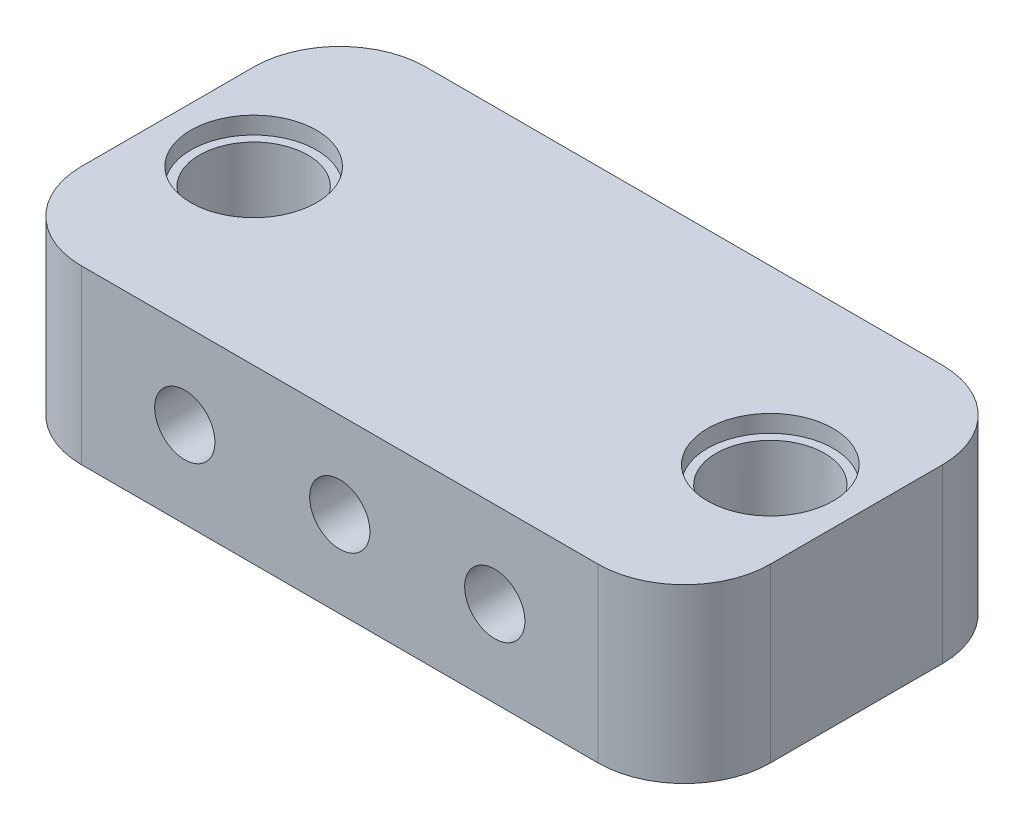
ISO-10303-21;
HEADER;
FILE_DESCRIPTION(('STEP AP214'),'2;1');
FILE_NAME('part.step','',(''),(''),'','','');
FILE_SCHEMA(('AUTOMOTIVE_DESIGN { 1 0 10303 214 1 1 1 1 }'));
ENDSEC;
DATA;
#1=APPLICATION_CONTEXT('core data for automotive mechanical design processes');
#2=APPLICATION_PROTOCOL_DEFINITION('international standard','automotive_design',2000,#1);
#3=PRODUCT_CONTEXT('',#1,'mechanical');
#4=PRODUCT('Part','Part','',(#3));
#5=PRODUCT_RELATED_PRODUCT_CATEGORY('part','',(#4));
#6=PRODUCT_DEFINITION_FORMATION('','',#4);
#7=PRODUCT_DEFINITION_CONTEXT('part definition',#1,'design');
#8=PRODUCT_DEFINITION('design','',#6,#7);
#9=PRODUCT_DEFINITION_SHAPE('','',#8);
#10=(LENGTH_UNIT() NAMED_UNIT(*) SI_UNIT(.MILLI.,.METRE.));
#11=(NAMED_UNIT(*) PLANE_ANGLE_UNIT() SI_UNIT($,.RADIAN.));
#12=(NAMED_UNIT(*) SI_UNIT($,.STERADIAN.) SOLID_ANGLE_UNIT());
#13=UNCERTAINTY_MEASURE_WITH_UNIT(LENGTH_MEASURE(1.E-05),#10,'distance_accuracy_value','');
#14=(GEOMETRIC_REPRESENTATION_CONTEXT(3) GLOBAL_UNCERTAINTY_ASSIGNED_CONTEXT((#13)) GLOBAL_UNIT_ASSIGNED_CONTEXT((#10,
#11,#12)) REPRESENTATION_CONTEXT('',''));
#15=CARTESIAN_POINT('',(0.,0.,0.));
#16=DIRECTION('',(0.,0.,1.));
#17=DIRECTION('',(1.,0.,0.));
#18=AXIS2_PLACEMENT_3D('',#15,#16,#17);
#19=CARTESIAN_POINT('',(35.,0.,10.));
#20=DIRECTION('',(0.,1.,0.));
#21=DIRECTION('',(0.,0.,1.));
#22=AXIS2_PLACEMENT_3D('',#19,#20,#21);
#23=CYLINDRICAL_SURFACE('',#22,3.15);
#24=CARTESIAN_POINT('',(35.,0.,10.));
#25=DIRECTION('',(0.,1.,0.));
#26=DIRECTION('',(0.,0.,-1.));
#27=AXIS2_PLACEMENT_3D('',#24,#25,#26);
#28=CIRCLE('',#27,3.15);
#29=CARTESIAN_POINT('',(35.,0.,6.85));
#30=VERTEX_POINT('',#29);
#31=EDGE_CURVE('E179',#30,#30,#28,.T.);
#32=ORIENTED_EDGE('',*,*,#31,.F.);
#33=EDGE_LOOP('',(#32));
#34=FACE_BOUND('',#33,.T.);
#35=CARTESIAN_POINT('',(35.,9.,10.));
#36=DIRECTION('',(0.,1.,0.));
#37=DIRECTION('',(0.,0.,1.));
#38=AXIS2_PLACEMENT_3D('',#35,#36,#37);
#39=CIRCLE('',#38,3.15);
#40=CARTESIAN_POINT('',(35.,9.,13.15));
#41=VERTEX_POINT('',#40);
#42=EDGE_CURVE('E129',#41,#41,#39,.F.);
#43=ORIENTED_EDGE('',*,*,#42,.F.);
#44=EDGE_LOOP('',(#43));
#45=FACE_BOUND('',#44,.T.);
#46=ADVANCED_FACE('F33',(#34,#45),#23,.F.);
#47=CARTESIAN_POINT('',(5.,0.,10.));
#48=DIRECTION('',(0.,1.,0.));
#49=DIRECTION('',(0.,0.,1.));
#50=AXIS2_PLACEMENT_3D('',#47,#48,#49);
#51=CYLINDRICAL_SURFACE('',#50,3.15);
#52=CARTESIAN_POINT('',(5.,0.,10.));
#53=DIRECTION('',(0.,1.,0.));
#54=DIRECTION('',(0.,0.,1.));
#55=AXIS2_PLACEMENT_3D('',#52,#53,#54);
#56=CIRCLE('',#55,3.15);
#57=CARTESIAN_POINT('',(5.,0.,13.15));
#58=VERTEX_POINT('',#57);
#59=EDGE_CURVE('E184',#58,#58,#56,.T.);
#60=ORIENTED_EDGE('',*,*,#59,.F.);
#61=EDGE_LOOP('',(#60));
#62=FACE_BOUND('',#61,.T.);
#63=CARTESIAN_POINT('',(5.,9.,10.));
#64=DIRECTION('',(0.,1.,0.));
#65=DIRECTION('',(0.,0.,1.));
#66=AXIS2_PLACEMENT_3D('',#63,#64,#65);
#67=CIRCLE('',#66,3.15);
#68=CARTESIAN_POINT('',(5.,9.,13.15));
#69=VERTEX_POINT('',#68);
#70=EDGE_CURVE('E177',#69,#69,#67,.F.);
#71=ORIENTED_EDGE('',*,*,#70,.F.);
#72=EDGE_LOOP('',(#71));
#73=FACE_BOUND('',#72,.T.);
#74=ADVANCED_FACE('F235',(#62,#73),#51,.F.);
#75=CARTESIAN_POINT('',(0.,0.,20.));
#76=DIRECTION('',(1.,0.,0.));
#77=DIRECTION('',(0.,0.,-1.));
#78=AXIS2_PLACEMENT_3D('',#75,#76,#77);
#79=PLANE('',#78);
#80=DIRECTION('',(0.,0.,-1.));
#81=VECTOR('',#80,1.);
#82=CARTESIAN_POINT('',(0.,10.,20.));
#83=LINE('',#82,#81);
#84=CARTESIAN_POINT('',(0.,10.,15.));
#85=VERTEX_POINT('',#84);
#86=CARTESIAN_POINT('',(0.,10.,5.));
#87=VERTEX_POINT('',#86);
#88=EDGE_CURVE('E166',#85,#87,#83,.T.);
#89=ORIENTED_EDGE('',*,*,#88,.T.);
#90=DIRECTION('',(0.,-1.,0.));
#91=VECTOR('',#90,1.);
#92=CARTESIAN_POINT('',(0.,0.,5.));
#93=LINE('',#92,#91);
#94=CARTESIAN_POINT('',(0.,0.,5.));
#95=VERTEX_POINT('',#94);
#96=EDGE_CURVE('E119',#87,#95,#93,.T.);
#97=ORIENTED_EDGE('',*,*,#96,.T.);
#98=DIRECTION('',(0.,0.,-1.));
#99=VECTOR('',#98,1.);
#100=CARTESIAN_POINT('',(0.,0.,20.));
#101=LINE('',#100,#99);
#102=CARTESIAN_POINT('',(0.,0.,15.));
#103=VERTEX_POINT('',#102);
#104=EDGE_CURVE('E102',#103,#95,#101,.T.);
#105=ORIENTED_EDGE('',*,*,#104,.F.);
#106=DIRECTION('',(0.,-1.,0.));
#107=VECTOR('',#106,1.);
#108=CARTESIAN_POINT('',(0.,0.,15.));
#109=LINE('',#108,#107);
#110=EDGE_CURVE('E116',#103,#85,#109,.F.);
#111=ORIENTED_EDGE('',*,*,#110,.T.);
#112=EDGE_LOOP('',(#89,#97,#105,#111));
#113=FACE_BOUND('',#112,.T.);
#114=ADVANCED_FACE('F115',(#113),#79,.F.);
#115=CARTESIAN_POINT('',(0.,0.,20.));
#116=DIRECTION('',(0.,1.,0.));
#117=DIRECTION('',(0.,0.,1.));
#118=AXIS2_PLACEMENT_3D('',#115,#116,#117);
#119=PLANE('',#118);
#120=ORIENTED_EDGE('',*,*,#31,.T.);
#121=EDGE_LOOP('',(#120));
#122=FACE_BOUND('',#121,.T.);
#123=ORIENTED_EDGE('',*,*,#59,.T.);
#124=EDGE_LOOP('',(#123));
#125=FACE_BOUND('',#124,.T.);
#126=ORIENTED_EDGE('',*,*,#104,.T.);
#127=CARTESIAN_POINT('',(5.,0.,5.));
#128=DIRECTION('',(0.,1.,0.));
#129=DIRECTION('',(0.,0.,1.));
#130=AXIS2_PLACEMENT_3D('',#127,#128,#129);
#131=CIRCLE('',#130,5.);
#132=CARTESIAN_POINT('',(5.,0.,0.));
#133=VERTEX_POINT('',#132);
#134=EDGE_CURVE('E109',#95,#133,#131,.F.);
#135=ORIENTED_EDGE('',*,*,#134,.T.);
#136=DIRECTION('',(1.,0.,0.));
#137=VECTOR('',#136,1.);
#138=CARTESIAN_POINT('',(0.,0.,0.));
#139=LINE('',#138,#137);
#140=CARTESIAN_POINT('',(35.,0.,0.));
#141=VERTEX_POINT('',#140);
#142=EDGE_CURVE('E173',#133,#141,#139,.T.);
#143=ORIENTED_EDGE('',*,*,#142,.T.);
#144=CARTESIAN_POINT('',(35.,0.,5.));
#145=DIRECTION('',(0.,1.,0.));
#146=DIRECTION('',(0.,0.,1.));
#147=AXIS2_PLACEMENT_3D('',#144,#145,#146);
#148=CIRCLE('',#147,5.);
#149=CARTESIAN_POINT('',(40.,0.,5.));
#150=VERTEX_POINT('',#149);
#151=EDGE_CURVE('E110',#141,#150,#148,.F.);
#152=ORIENTED_EDGE('',*,*,#151,.T.);
#153=DIRECTION('',(0.,0.,-1.));
#154=VECTOR('',#153,1.);
#155=CARTESIAN_POINT('',(40.,0.,20.));
#156=LINE('',#155,#154);
#157=CARTESIAN_POINT('',(40.,0.,15.));
#158=VERTEX_POINT('',#157);
#159=EDGE_CURVE('E120',#158,#150,#156,.T.);
#160=ORIENTED_EDGE('',*,*,#159,.F.);
#161=CARTESIAN_POINT('',(35.,0.,15.));
#162=DIRECTION('',(0.,1.,0.));
#163=DIRECTION('',(0.,0.,1.));
#164=AXIS2_PLACEMENT_3D('',#161,#162,#163);
#165=CIRCLE('',#164,5.);
#166=CARTESIAN_POINT('',(35.,0.,20.));
#167=VERTEX_POINT('',#166);
#168=EDGE_CURVE('E126',#158,#167,#165,.F.);
#169=ORIENTED_EDGE('',*,*,#168,.T.);
#170=DIRECTION('',(1.,0.,0.));
#171=VECTOR('',#170,1.);
#172=CARTESIAN_POINT('',(0.,0.,20.));
#173=LINE('',#172,#171);
#174=CARTESIAN_POINT('',(5.,0.,20.));
#175=VERTEX_POINT('',#174);
#176=EDGE_CURVE('E104',#175,#167,#173,.T.);
#177=ORIENTED_EDGE('',*,*,#176,.F.);
#178=CARTESIAN_POINT('',(5.,0.,15.));
#179=DIRECTION('',(0.,1.,0.));
#180=DIRECTION('',(0.,0.,1.));
#181=AXIS2_PLACEMENT_3D('',#178,#179,#180);
#182=CIRCLE('',#181,5.);
#183=EDGE_CURVE('E99',#175,#103,#182,.F.);
#184=ORIENTED_EDGE('',*,*,#183,.T.);
#185=EDGE_LOOP('',(#126,#135,#143,#152,#160,#169,#177,#184));
#186=FACE_BOUND('',#185,.T.);
#187=ADVANCED_FACE('F101',(#122,#125,#186),#119,.F.);
#188=CARTESIAN_POINT('',(40.,0.,20.));
#189=DIRECTION('',(-1.,0.,0.));
#190=DIRECTION('',(0.,0.,1.));
#191=AXIS2_PLACEMENT_3D('',#188,#189,#190);
#192=PLANE('',#191);
#193=ORIENTED_EDGE('',*,*,#159,.T.);
#194=DIRECTION('',(0.,1.,0.));
#195=VECTOR('',#194,1.);
#196=CARTESIAN_POINT('',(40.,10.,5.));
#197=LINE('',#196,#195);
#198=CARTESIAN_POINT('',(40.,10.,5.));
#199=VERTEX_POINT('',#198);
#200=EDGE_CURVE('E11',#150,#199,#197,.T.);
#201=ORIENTED_EDGE('',*,*,#200,.T.);
#202=DIRECTION('',(0.,0.,-1.));
#203=VECTOR('',#202,1.);
#204=CARTESIAN_POINT('',(40.,10.,20.));
#205=LINE('',#204,#203);
#206=CARTESIAN_POINT('',(40.,10.,15.));
#207=VERTEX_POINT('',#206);
#208=EDGE_CURVE('E153',#207,#199,#205,.T.);
#209=ORIENTED_EDGE('',*,*,#208,.F.);
#210=DIRECTION('',(0.,1.,0.));
#211=VECTOR('',#210,1.);
#212=CARTESIAN_POINT('',(40.,0.,15.));
#213=LINE('',#212,#211);
#214=EDGE_CURVE('E41',#207,#158,#213,.F.);
#215=ORIENTED_EDGE('',*,*,#214,.T.);
#216=EDGE_LOOP('',(#193,#201,#209,#215));
#217=FACE_BOUND('',#216,.T.);
#218=ADVANCED_FACE('F152',(#217),#192,.F.);
#219=CARTESIAN_POINT('',(0.,10.,20.));
#220=DIRECTION('',(0.,-1.,0.));
#221=DIRECTION('',(0.,0.,-1.));
#222=AXIS2_PLACEMENT_3D('',#219,#220,#221);
#223=PLANE('',#222);
#224=CARTESIAN_POINT('',(35.,10.,10.));
#225=DIRECTION('',(0.,1.,0.));
#226=DIRECTION('',(0.,0.,1.));
#227=AXIS2_PLACEMENT_3D('',#224,#225,#226);
#228=CIRCLE('',#227,3.65);
#229=CARTESIAN_POINT('',(35.,10.,13.65));
#230=VERTEX_POINT('',#229);
#231=EDGE_CURVE('E194',#230,#230,#228,.T.);
#232=ORIENTED_EDGE('',*,*,#231,.F.);
#233=EDGE_LOOP('',(#232));
#234=FACE_BOUND('',#233,.T.);
#235=CARTESIAN_POINT('',(5.,10.,10.));
#236=DIRECTION('',(0.,1.,0.));
#237=DIRECTION('',(0.,0.,1.));
#238=AXIS2_PLACEMENT_3D('',#235,#236,#237);
#239=CIRCLE('',#238,3.65);
#240=CARTESIAN_POINT('',(5.,10.,13.65));
#241=VERTEX_POINT('',#240);
#242=EDGE_CURVE('E187',#241,#241,#239,.T.);
#243=ORIENTED_EDGE('',*,*,#242,.F.);
#244=EDGE_LOOP('',(#243));
#245=FACE_BOUND('',#244,.T.);
#246=DIRECTION('',(-1.,0.,0.));
#247=VECTOR('',#246,1.);
#248=CARTESIAN_POINT('',(0.,10.,0.));
#249=LINE('',#248,#247);
#250=CARTESIAN_POINT('',(35.,10.,0.));
#251=VERTEX_POINT('',#250);
#252=CARTESIAN_POINT('',(5.,10.,0.));
#253=VERTEX_POINT('',#252);
#254=EDGE_CURVE('E169',#251,#253,#249,.T.);
#255=ORIENTED_EDGE('',*,*,#254,.T.);
#256=CARTESIAN_POINT('',(5.,10.,5.));
#257=DIRECTION('',(0.,-1.,0.));
#258=DIRECTION('',(0.,0.,-1.));
#259=AXIS2_PLACEMENT_3D('',#256,#257,#258);
#260=CIRCLE('',#259,5.);
#261=EDGE_CURVE('E142',#253,#87,#260,.F.);
#262=ORIENTED_EDGE('',*,*,#261,.T.);
#263=ORIENTED_EDGE('',*,*,#88,.F.);
#264=CARTESIAN_POINT('',(5.,10.,15.));
#265=DIRECTION('',(0.,-1.,0.));
#266=DIRECTION('',(0.,0.,-1.));
#267=AXIS2_PLACEMENT_3D('',#264,#265,#266);
#268=CIRCLE('',#267,5.);
#269=CARTESIAN_POINT('',(5.,10.,20.));
#270=VERTEX_POINT('',#269);
#271=EDGE_CURVE('E124',#85,#270,#268,.F.);
#272=ORIENTED_EDGE('',*,*,#271,.T.);
#273=DIRECTION('',(-1.,0.,0.));
#274=VECTOR('',#273,1.);
#275=CARTESIAN_POINT('',(0.,10.,20.));
#276=LINE('',#275,#274);
#277=CARTESIAN_POINT('',(35.,10.,20.));
#278=VERTEX_POINT('',#277);
#279=EDGE_CURVE('E163',#278,#270,#276,.T.);
#280=ORIENTED_EDGE('',*,*,#279,.F.);
#281=CARTESIAN_POINT('',(35.,10.,15.));
#282=DIRECTION('',(0.,-1.,0.));
#283=DIRECTION('',(0.,0.,-1.));
#284=AXIS2_PLACEMENT_3D('',#281,#282,#283);
#285=CIRCLE('',#284,5.);
#286=EDGE_CURVE('E55',#278,#207,#285,.F.);
#287=ORIENTED_EDGE('',*,*,#286,.T.);
#288=ORIENTED_EDGE('',*,*,#208,.T.);
#289=CARTESIAN_POINT('',(35.,10.,5.));
#290=DIRECTION('',(0.,-1.,0.));
#291=DIRECTION('',(0.,0.,-1.));
#292=AXIS2_PLACEMENT_3D('',#289,#290,#291);
#293=CIRCLE('',#292,5.);
#294=EDGE_CURVE('E48',#199,#251,#293,.F.);
#295=ORIENTED_EDGE('',*,*,#294,.T.);
#296=EDGE_LOOP('',(#255,#262,#263,#272,#280,#287,#288,#295));
#297=FACE_BOUND('',#296,.T.);
#298=ADVANCED_FACE('F165',(#234,#245,#297),#223,.F.);
#299=CARTESIAN_POINT('',(0.,0.,20.));
#300=DIRECTION('',(0.,0.,-1.));
#301=DIRECTION('',(-1.,0.,0.));
#302=AXIS2_PLACEMENT_3D('',#299,#300,#301);
#303=PLANE('',#302);
#304=CARTESIAN_POINT('',(11.,5.,20.));
#305=DIRECTION('',(0.,0.,-1.));
#306=DIRECTION('',(-1.,0.,0.));
#307=AXIS2_PLACEMENT_3D('',#304,#305,#306);
#308=CIRCLE('',#307,1.75);
#309=CARTESIAN_POINT('',(9.25,5.,20.));
#310=VERTEX_POINT('',#309);
#311=EDGE_CURVE('E208',#310,#310,#308,.T.);
#312=ORIENTED_EDGE('',*,*,#311,.T.);
#313=EDGE_LOOP('',(#312));
#314=FACE_BOUND('',#313,.T.);
#315=CARTESIAN_POINT('',(29.,5.,20.));
#316=DIRECTION('',(0.,0.,-1.));
#317=DIRECTION('',(-1.,0.,0.));
#318=AXIS2_PLACEMENT_3D('',#315,#316,#317);
#319=CIRCLE('',#318,1.75);
#320=CARTESIAN_POINT('',(27.25,5.,20.));
#321=VERTEX_POINT('',#320);
#322=EDGE_CURVE('E203',#321,#321,#319,.T.);
#323=ORIENTED_EDGE('',*,*,#322,.T.);
#324=EDGE_LOOP('',(#323));
#325=FACE_BOUND('',#324,.T.);
#326=CARTESIAN_POINT('',(20.,5.,20.));
#327=DIRECTION('',(0.,0.,-1.));
#328=DIRECTION('',(-1.,0.,0.));
#329=AXIS2_PLACEMENT_3D('',#326,#327,#328);
#330=CIRCLE('',#329,1.75);
#331=CARTESIAN_POINT('',(18.25,5.,20.));
#332=VERTEX_POINT('',#331);
#333=EDGE_CURVE('E175',#332,#332,#330,.T.);
#334=ORIENTED_EDGE('',*,*,#333,.T.);
#335=EDGE_LOOP('',(#334));
#336=FACE_BOUND('',#335,.T.);
#337=ORIENTED_EDGE('',*,*,#279,.T.);
#338=DIRECTION('',(0.,-1.,0.));
#339=VECTOR('',#338,1.);
#340=CARTESIAN_POINT('',(5.,0.,20.));
#341=LINE('',#340,#339);
#342=EDGE_CURVE('E147',#270,#175,#341,.T.);
#343=ORIENTED_EDGE('',*,*,#342,.T.);
#344=ORIENTED_EDGE('',*,*,#176,.T.);
#345=DIRECTION('',(0.,1.,0.));
#346=VECTOR('',#345,1.);
#347=CARTESIAN_POINT('',(35.,0.,20.));
#348=LINE('',#347,#346);
#349=EDGE_CURVE('E144',#167,#278,#348,.T.);
#350=ORIENTED_EDGE('',*,*,#349,.T.);
#351=EDGE_LOOP('',(#337,#343,#344,#350));
#352=FACE_BOUND('',#351,.T.);
#353=ADVANCED_FACE('F162',(#314,#325,#336,#352),#303,.F.);
#354=CARTESIAN_POINT('',(0.,0.,0.));
#355=DIRECTION('',(0.,0.,-1.));
#356=DIRECTION('',(-1.,0.,0.));
#357=AXIS2_PLACEMENT_3D('',#354,#355,#356);
#358=PLANE('',#357);
#359=CARTESIAN_POINT('',(11.,5.,0.));
#360=DIRECTION('',(0.,0.,1.));
#361=DIRECTION('',(1.,0.,0.));
#362=AXIS2_PLACEMENT_3D('',#359,#360,#361);
#363=CIRCLE('',#362,1.75);
#364=CARTESIAN_POINT('',(12.75,5.,0.));
#365=VERTEX_POINT('',#364);
#366=EDGE_CURVE('E200',#365,#365,#363,.T.);
#367=ORIENTED_EDGE('',*,*,#366,.T.);
#368=EDGE_LOOP('',(#367));
#369=FACE_BOUND('',#368,.T.);
#370=CARTESIAN_POINT('',(29.,5.,0.));
#371=DIRECTION('',(0.,0.,1.));
#372=DIRECTION('',(-1.,0.,0.));
#373=AXIS2_PLACEMENT_3D('',#370,#371,#372);
#374=CIRCLE('',#373,1.75);
#375=CARTESIAN_POINT('',(27.25,5.,0.));
#376=VERTEX_POINT('',#375);
#377=EDGE_CURVE('E199',#376,#376,#374,.T.);
#378=ORIENTED_EDGE('',*,*,#377,.T.);
#379=EDGE_LOOP('',(#378));
#380=FACE_BOUND('',#379,.T.);
#381=CARTESIAN_POINT('',(20.,5.,0.));
#382=DIRECTION('',(0.,0.,1.));
#383=DIRECTION('',(1.,0.,0.));
#384=AXIS2_PLACEMENT_3D('',#381,#382,#383);
#385=CIRCLE('',#384,1.75);
#386=CARTESIAN_POINT('',(21.75,5.,0.));
#387=VERTEX_POINT('',#386);
#388=EDGE_CURVE('E211',#387,#387,#385,.T.);
#389=ORIENTED_EDGE('',*,*,#388,.T.);
#390=EDGE_LOOP('',(#389));
#391=FACE_BOUND('',#390,.T.);
#392=ORIENTED_EDGE('',*,*,#142,.F.);
#393=DIRECTION('',(0.,-1.,0.));
#394=VECTOR('',#393,1.);
#395=CARTESIAN_POINT('',(5.,10.,0.));
#396=LINE('',#395,#394);
#397=EDGE_CURVE('E137',#133,#253,#396,.F.);
#398=ORIENTED_EDGE('',*,*,#397,.T.);
#399=ORIENTED_EDGE('',*,*,#254,.F.);
#400=DIRECTION('',(0.,1.,0.));
#401=VECTOR('',#400,1.);
#402=CARTESIAN_POINT('',(35.,0.,0.));
#403=LINE('',#402,#401);
#404=EDGE_CURVE('E135',#251,#141,#403,.F.);
#405=ORIENTED_EDGE('',*,*,#404,.T.);
#406=EDGE_LOOP('',(#392,#398,#399,#405));
#407=FACE_BOUND('',#406,.T.);
#408=ADVANCED_FACE('F220',(#369,#380,#391,#407),#358,.T.);
#409=CARTESIAN_POINT('',(20.,5.,0.));
#410=DIRECTION('',(0.,0.,1.));
#411=DIRECTION('',(1.,0.,0.));
#412=AXIS2_PLACEMENT_3D('',#409,#410,#411);
#413=CYLINDRICAL_SURFACE('',#412,1.75);
#414=ORIENTED_EDGE('',*,*,#388,.F.);
#415=EDGE_LOOP('',(#414));
#416=FACE_BOUND('',#415,.T.);
#417=ORIENTED_EDGE('',*,*,#333,.F.);
#418=EDGE_LOOP('',(#417));
#419=FACE_BOUND('',#418,.T.);
#420=ADVANCED_FACE('F217',(#416,#419),#413,.F.);
#421=CARTESIAN_POINT('',(29.,5.,0.));
#422=DIRECTION('',(0.,0.,1.));
#423=DIRECTION('',(1.,0.,0.));
#424=AXIS2_PLACEMENT_3D('',#421,#422,#423);
#425=CYLINDRICAL_SURFACE('',#424,1.75);
#426=ORIENTED_EDGE('',*,*,#377,.F.);
#427=EDGE_LOOP('',(#426));
#428=FACE_BOUND('',#427,.T.);
#429=ORIENTED_EDGE('',*,*,#322,.F.);
#430=EDGE_LOOP('',(#429));
#431=FACE_BOUND('',#430,.T.);
#432=ADVANCED_FACE('F219',(#428,#431),#425,.F.);
#433=CARTESIAN_POINT('',(11.,5.,0.));
#434=DIRECTION('',(0.,0.,1.));
#435=DIRECTION('',(1.,0.,0.));
#436=AXIS2_PLACEMENT_3D('',#433,#434,#435);
#437=CYLINDRICAL_SURFACE('',#436,1.75);
#438=ORIENTED_EDGE('',*,*,#366,.F.);
#439=EDGE_LOOP('',(#438));
#440=FACE_BOUND('',#439,.T.);
#441=ORIENTED_EDGE('',*,*,#311,.F.);
#442=EDGE_LOOP('',(#441));
#443=FACE_BOUND('',#442,.T.);
#444=ADVANCED_FACE('F227',(#440,#443),#437,.F.);
#445=CARTESIAN_POINT('',(5.,9.,10.));
#446=DIRECTION('',(0.,1.,0.));
#447=DIRECTION('',(0.,0.,1.));
#448=AXIS2_PLACEMENT_3D('',#445,#446,#447);
#449=PLANE('',#448);
#450=CARTESIAN_POINT('',(5.,9.,10.));
#451=DIRECTION('',(0.,1.,0.));
#452=DIRECTION('',(0.,0.,1.));
#453=AXIS2_PLACEMENT_3D('',#450,#451,#452);
#454=CIRCLE('',#453,3.65);
#455=CARTESIAN_POINT('',(5.,9.,13.65));
#456=VERTEX_POINT('',#455);
#457=EDGE_CURVE('E180',#456,#456,#454,.T.);
#458=ORIENTED_EDGE('',*,*,#457,.T.);
#459=EDGE_LOOP('',(#458));
#460=FACE_BOUND('',#459,.T.);
#461=ORIENTED_EDGE('',*,*,#70,.T.);
#462=EDGE_LOOP('',(#461));
#463=FACE_BOUND('',#462,.T.);
#464=ADVANCED_FACE('F250',(#460,#463),#449,.T.);
#465=CARTESIAN_POINT('',(5.,9.,10.));
#466=DIRECTION('',(0.,1.,0.));
#467=DIRECTION('',(0.,0.,1.));
#468=AXIS2_PLACEMENT_3D('',#465,#466,#467);
#469=CYLINDRICAL_SURFACE('',#468,3.65);
#470=ORIENTED_EDGE('',*,*,#457,.F.);
#471=EDGE_LOOP('',(#470));
#472=FACE_BOUND('',#471,.T.);
#473=ORIENTED_EDGE('',*,*,#242,.T.);
#474=EDGE_LOOP('',(#473));
#475=FACE_BOUND('',#474,.T.);
#476=ADVANCED_FACE('F246',(#472,#475),#469,.F.);
#477=CARTESIAN_POINT('',(35.,9.,10.));
#478=DIRECTION('',(0.,1.,0.));
#479=DIRECTION('',(0.,0.,1.));
#480=AXIS2_PLACEMENT_3D('',#477,#478,#479);
#481=PLANE('',#480);
#482=CARTESIAN_POINT('',(35.,9.,10.));
#483=DIRECTION('',(0.,1.,0.));
#484=DIRECTION('',(0.,0.,1.));
#485=AXIS2_PLACEMENT_3D('',#482,#483,#484);
#486=CIRCLE('',#485,3.65);
#487=CARTESIAN_POINT('',(35.,9.,13.65));
#488=VERTEX_POINT('',#487);
#489=EDGE_CURVE('E411',#488,#488,#486,.T.);
#490=ORIENTED_EDGE('',*,*,#489,.T.);
#491=EDGE_LOOP('',(#490));
#492=FACE_BOUND('',#491,.T.);
#493=ORIENTED_EDGE('',*,*,#42,.T.);
#494=EDGE_LOOP('',(#493));
#495=FACE_BOUND('',#494,.T.);
#496=ADVANCED_FACE('F354',(#492,#495),#481,.T.);
#497=CARTESIAN_POINT('',(35.,9.,10.));
#498=DIRECTION('',(0.,1.,0.));
#499=DIRECTION('',(0.,0.,1.));
#500=AXIS2_PLACEMENT_3D('',#497,#498,#499);
#501=CYLINDRICAL_SURFACE('',#500,3.65);
#502=ORIENTED_EDGE('',*,*,#489,.F.);
#503=EDGE_LOOP('',(#502));
#504=FACE_BOUND('',#503,.T.);
#505=ORIENTED_EDGE('',*,*,#231,.T.);
#506=EDGE_LOOP('',(#505));
#507=FACE_BOUND('',#506,.T.);
#508=ADVANCED_FACE('F279',(#504,#507),#501,.F.);
#509=CARTESIAN_POINT('',(5.,0.,5.));
#510=DIRECTION('',(0.,1.,0.));
#511=DIRECTION('',(0.,0.,1.));
#512=AXIS2_PLACEMENT_3D('',#509,#510,#511);
#513=CYLINDRICAL_SURFACE('',#512,5.);
#514=ORIENTED_EDGE('',*,*,#261,.F.);
#515=ORIENTED_EDGE('',*,*,#397,.F.);
#516=ORIENTED_EDGE('',*,*,#134,.F.);
#517=ORIENTED_EDGE('',*,*,#96,.F.);
#518=EDGE_LOOP('',(#514,#515,#516,#517));
#519=FACE_BOUND('',#518,.T.);
#520=ADVANCED_FACE('F276',(#519),#513,.T.);
#521=CARTESIAN_POINT('',(5.,0.,15.));
#522=DIRECTION('',(0.,-1.,0.));
#523=DIRECTION('',(0.,0.,-1.));
#524=AXIS2_PLACEMENT_3D('',#521,#522,#523);
#525=CYLINDRICAL_SURFACE('',#524,5.);
#526=ORIENTED_EDGE('',*,*,#271,.F.);
#527=ORIENTED_EDGE('',*,*,#110,.F.);
#528=ORIENTED_EDGE('',*,*,#183,.F.);
#529=ORIENTED_EDGE('',*,*,#342,.F.);
#530=EDGE_LOOP('',(#526,#527,#528,#529));
#531=FACE_BOUND('',#530,.T.);
#532=ADVANCED_FACE('F123',(#531),#525,.T.);
#533=CARTESIAN_POINT('',(35.,0.,5.));
#534=DIRECTION('',(0.,-1.,0.));
#535=DIRECTION('',(0.,0.,-1.));
#536=AXIS2_PLACEMENT_3D('',#533,#534,#535);
#537=CYLINDRICAL_SURFACE('',#536,5.);
#538=ORIENTED_EDGE('',*,*,#151,.F.);
#539=ORIENTED_EDGE('',*,*,#404,.F.);
#540=ORIENTED_EDGE('',*,*,#294,.F.);
#541=ORIENTED_EDGE('',*,*,#200,.F.);
#542=EDGE_LOOP('',(#538,#539,#540,#541));
#543=FACE_BOUND('',#542,.T.);
#544=ADVANCED_FACE('F282',(#543),#537,.T.);
#545=CARTESIAN_POINT('',(35.,0.,15.));
#546=DIRECTION('',(0.,1.,0.));
#547=DIRECTION('',(0.,0.,1.));
#548=AXIS2_PLACEMENT_3D('',#545,#546,#547);
#549=CYLINDRICAL_SURFACE('',#548,5.);
#550=ORIENTED_EDGE('',*,*,#168,.F.);
#551=ORIENTED_EDGE('',*,*,#214,.F.);
#552=ORIENTED_EDGE('',*,*,#286,.F.);
#553=ORIENTED_EDGE('',*,*,#349,.F.);
#554=EDGE_LOOP('',(#550,#551,#552,#553));
#555=FACE_BOUND('',#554,.T.);
#556=ADVANCED_FACE('F35',(#555),#549,.T.);
#557=CLOSED_SHELL('',(#46,#74,#114,#187,#218,#298,#353,#408,#420,#432,#444,#464,#476,#496,#508,
#520,#532,#544,#556));
#558=MANIFOLD_SOLID_BREP('B2',#557);
#559=ADVANCED_BREP_SHAPE_REPRESENTATION('',(#18,#558),#14);
#560=SHAPE_DEFINITION_REPRESENTATION(#9,#559);
ENDSEC;
END-ISO-10303-21;
